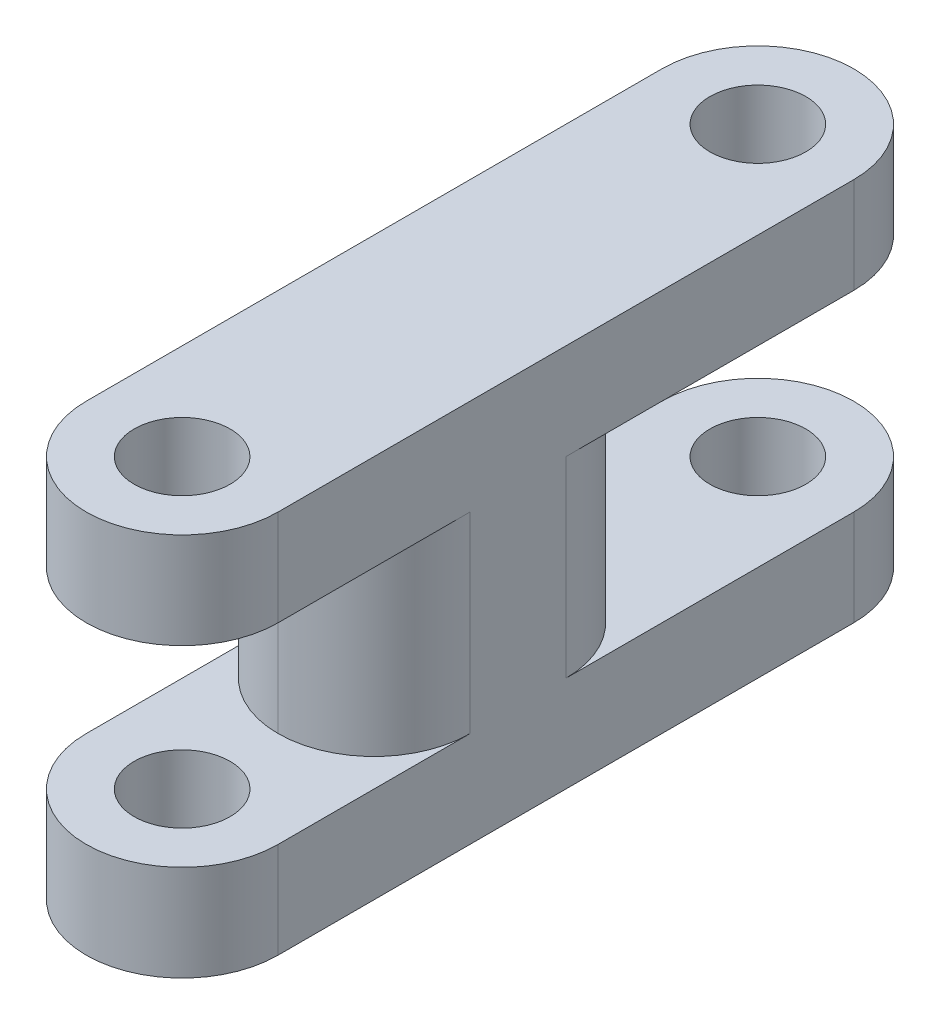
ISO-10303-21;
HEADER;
FILE_DESCRIPTION(('STEP AP214'),'2;1');
FILE_NAME('part.step','',(''),(''),'','','');
FILE_SCHEMA(('AUTOMOTIVE_DESIGN { 1 0 10303 214 1 1 1 1 }'));
ENDSEC;
DATA;
#1=APPLICATION_CONTEXT('core data for automotive mechanical design processes');
#2=APPLICATION_PROTOCOL_DEFINITION('international standard','automotive_design',2000,#1);
#3=PRODUCT_CONTEXT('',#1,'mechanical');
#4=PRODUCT('Part','Part','',(#3));
#5=PRODUCT_RELATED_PRODUCT_CATEGORY('part','',(#4));
#6=PRODUCT_DEFINITION_FORMATION('','',#4);
#7=PRODUCT_DEFINITION_CONTEXT('part definition',#1,'design');
#8=PRODUCT_DEFINITION('design','',#6,#7);
#9=PRODUCT_DEFINITION_SHAPE('','',#8);
#10=(LENGTH_UNIT() NAMED_UNIT(*) SI_UNIT(.MILLI.,.METRE.));
#11=(NAMED_UNIT(*) PLANE_ANGLE_UNIT() SI_UNIT($,.RADIAN.));
#12=(NAMED_UNIT(*) SI_UNIT($,.STERADIAN.) SOLID_ANGLE_UNIT());
#13=UNCERTAINTY_MEASURE_WITH_UNIT(LENGTH_MEASURE(1.E-05),#10,'distance_accuracy_value','');
#14=(GEOMETRIC_REPRESENTATION_CONTEXT(3) GLOBAL_UNCERTAINTY_ASSIGNED_CONTEXT((#13)) GLOBAL_UNIT_ASSIGNED_CONTEXT((#10,
#11,#12)) REPRESENTATION_CONTEXT('',''));
#15=CARTESIAN_POINT('',(0.,0.,0.));
#16=DIRECTION('',(0.,0.,1.));
#17=DIRECTION('',(1.,0.,0.));
#18=AXIS2_PLACEMENT_3D('',#15,#16,#17);
#19=CARTESIAN_POINT('',(5.,20.,0.));
#20=DIRECTION('',(-1.,0.,0.));
#21=DIRECTION('',(0.,0.,1.));
#22=AXIS2_PLACEMENT_3D('',#19,#20,#21);
#23=PLANE('',#22);
#24=DIRECTION('',(0.,1.,0.));
#25=VECTOR('',#24,1.);
#26=CARTESIAN_POINT('',(5.,20.,-15.));
#27=LINE('',#26,#25);
#28=CARTESIAN_POINT('',(5.,5.,-15.));
#29=VERTEX_POINT('',#28);
#30=CARTESIAN_POINT('',(5.,15.,-15.));
#31=VERTEX_POINT('',#30);
#32=EDGE_CURVE('E158',#29,#31,#27,.T.);
#33=ORIENTED_EDGE('',*,*,#32,.T.);
#34=DIRECTION('',(0.,0.,-1.));
#35=VECTOR('',#34,1.);
#36=CARTESIAN_POINT('',(5.,15.,-35.));
#37=LINE('',#36,#35);
#38=CARTESIAN_POINT('',(5.,15.,-30.));
#39=VERTEX_POINT('',#38);
#40=EDGE_CURVE('E143',#31,#39,#37,.T.);
#41=ORIENTED_EDGE('',*,*,#40,.T.);
#42=DIRECTION('',(0.,-1.,0.));
#43=VECTOR('',#42,1.);
#44=CARTESIAN_POINT('',(5.,20.,-30.));
#45=LINE('',#44,#43);
#46=CARTESIAN_POINT('',(5.,20.,-30.));
#47=VERTEX_POINT('',#46);
#48=EDGE_CURVE('E155',#47,#39,#45,.T.);
#49=ORIENTED_EDGE('',*,*,#48,.F.);
#50=DIRECTION('',(0.,0.,-1.));
#51=VECTOR('',#50,1.);
#52=CARTESIAN_POINT('',(5.,20.,0.));
#53=LINE('',#52,#51);
#54=CARTESIAN_POINT('',(5.,20.,0.));
#55=VERTEX_POINT('',#54);
#56=EDGE_CURVE('E292',#55,#47,#53,.T.);
#57=ORIENTED_EDGE('',*,*,#56,.F.);
#58=DIRECTION('',(0.,-1.,0.));
#59=VECTOR('',#58,1.);
#60=CARTESIAN_POINT('',(5.,20.,0.));
#61=LINE('',#60,#59);
#62=CARTESIAN_POINT('',(5.,15.,0.));
#63=VERTEX_POINT('',#62);
#64=EDGE_CURVE('E171',#55,#63,#61,.T.);
#65=ORIENTED_EDGE('',*,*,#64,.T.);
#66=DIRECTION('',(0.,0.,1.));
#67=VECTOR('',#66,1.);
#68=CARTESIAN_POINT('',(5.,15.,5.));
#69=LINE('',#68,#67);
#70=CARTESIAN_POINT('',(5.,15.,-10.));
#71=VERTEX_POINT('',#70);
#72=EDGE_CURVE('E185',#71,#63,#69,.T.);
#73=ORIENTED_EDGE('',*,*,#72,.F.);
#74=DIRECTION('',(0.,1.,0.));
#75=VECTOR('',#74,1.);
#76=CARTESIAN_POINT('',(5.,20.,-10.));
#77=LINE('',#76,#75);
#78=CARTESIAN_POINT('',(5.,5.,-10.));
#79=VERTEX_POINT('',#78);
#80=EDGE_CURVE('E203',#71,#79,#77,.F.);
#81=ORIENTED_EDGE('',*,*,#80,.T.);
#82=DIRECTION('',(0.,0.,-1.));
#83=VECTOR('',#82,1.);
#84=CARTESIAN_POINT('',(5.,5.,5.));
#85=LINE('',#84,#83);
#86=CARTESIAN_POINT('',(5.,5.,0.));
#87=VERTEX_POINT('',#86);
#88=EDGE_CURVE('E255',#87,#79,#85,.T.);
#89=ORIENTED_EDGE('',*,*,#88,.F.);
#90=CARTESIAN_POINT('',(5.,0.,0.));
#91=VERTEX_POINT('',#90);
#92=EDGE_CURVE('E166',#87,#91,#61,.T.);
#93=ORIENTED_EDGE('',*,*,#92,.T.);
#94=DIRECTION('',(0.,0.,-1.));
#95=VECTOR('',#94,1.);
#96=CARTESIAN_POINT('',(5.,0.,0.));
#97=LINE('',#96,#95);
#98=CARTESIAN_POINT('',(5.,0.,-30.));
#99=VERTEX_POINT('',#98);
#100=EDGE_CURVE('E305',#91,#99,#97,.T.);
#101=ORIENTED_EDGE('',*,*,#100,.T.);
#102=CARTESIAN_POINT('',(5.,5.,-30.));
#103=VERTEX_POINT('',#102);
#104=EDGE_CURVE('E167',#103,#99,#45,.T.);
#105=ORIENTED_EDGE('',*,*,#104,.F.);
#106=DIRECTION('',(0.,0.,1.));
#107=VECTOR('',#106,1.);
#108=CARTESIAN_POINT('',(5.,5.,-35.));
#109=LINE('',#108,#107);
#110=EDGE_CURVE('E160',#103,#29,#109,.T.);
#111=ORIENTED_EDGE('',*,*,#110,.T.);
#112=EDGE_LOOP('',(#33,#41,#49,#57,#65,#73,#81,#89,#93,#101,#105,#111));
#113=FACE_BOUND('',#112,.T.);
#114=ADVANCED_FACE('F39',(#113),#23,.F.);
#115=CARTESIAN_POINT('',(0.,20.,-30.));
#116=DIRECTION('',(0.,-1.,0.));
#117=DIRECTION('',(0.,0.,-1.));
#118=AXIS2_PLACEMENT_3D('',#115,#116,#117);
#119=CYLINDRICAL_SURFACE('',#118,5.);
#120=CARTESIAN_POINT('',(0.,5.,-30.));
#121=DIRECTION('',(0.,1.,0.));
#122=DIRECTION('',(0.,0.,1.));
#123=AXIS2_PLACEMENT_3D('',#120,#121,#122);
#124=CIRCLE('',#123,5.);
#125=CARTESIAN_POINT('',(-5.,5.,-30.));
#126=VERTEX_POINT('',#125);
#127=EDGE_CURVE('E252',#103,#126,#124,.T.);
#128=ORIENTED_EDGE('',*,*,#127,.F.);
#129=ORIENTED_EDGE('',*,*,#104,.T.);
#130=CARTESIAN_POINT('',(0.,0.,-30.));
#131=DIRECTION('',(0.,1.,0.));
#132=DIRECTION('',(0.,0.,1.));
#133=AXIS2_PLACEMENT_3D('',#130,#131,#132);
#134=CIRCLE('',#133,5.);
#135=CARTESIAN_POINT('',(-5.,0.,-30.));
#136=VERTEX_POINT('',#135);
#137=EDGE_CURVE('E309',#99,#136,#134,.T.);
#138=ORIENTED_EDGE('',*,*,#137,.T.);
#139=DIRECTION('',(0.,-1.,0.));
#140=VECTOR('',#139,1.);
#141=CARTESIAN_POINT('',(-5.,20.,-30.));
#142=LINE('',#141,#140);
#143=EDGE_CURVE('E318',#126,#136,#142,.T.);
#144=ORIENTED_EDGE('',*,*,#143,.F.);
#145=EDGE_LOOP('',(#128,#129,#138,#144));
#146=FACE_BOUND('',#145,.T.);
#147=ADVANCED_FACE('F364',(#146),#119,.T.);
#148=CARTESIAN_POINT('',(0.,15.,-30.));
#149=DIRECTION('',(0.,-1.,0.));
#150=DIRECTION('',(0.,0.,-1.));
#151=AXIS2_PLACEMENT_3D('',#148,#149,#150);
#152=CIRCLE('',#151,5.);
#153=CARTESIAN_POINT('',(-5.,15.,-30.));
#154=VERTEX_POINT('',#153);
#155=EDGE_CURVE('E140',#154,#39,#152,.T.);
#156=ORIENTED_EDGE('',*,*,#155,.F.);
#157=CARTESIAN_POINT('',(-5.,20.,-30.));
#158=VERTEX_POINT('',#157);
#159=EDGE_CURVE('E173',#158,#154,#142,.T.);
#160=ORIENTED_EDGE('',*,*,#159,.F.);
#161=CARTESIAN_POINT('',(0.,20.,-30.));
#162=DIRECTION('',(0.,1.,0.));
#163=DIRECTION('',(0.,0.,1.));
#164=AXIS2_PLACEMENT_3D('',#161,#162,#163);
#165=CIRCLE('',#164,5.);
#166=EDGE_CURVE('E164',#47,#158,#165,.T.);
#167=ORIENTED_EDGE('',*,*,#166,.F.);
#168=ORIENTED_EDGE('',*,*,#48,.T.);
#169=EDGE_LOOP('',(#156,#160,#167,#168));
#170=FACE_BOUND('',#169,.T.);
#171=ADVANCED_FACE('F163',(#170),#119,.T.);
#172=CARTESIAN_POINT('',(-5.,20.,0.));
#173=DIRECTION('',(1.,0.,0.));
#174=DIRECTION('',(0.,0.,-1.));
#175=AXIS2_PLACEMENT_3D('',#172,#173,#174);
#176=PLANE('',#175);
#177=DIRECTION('',(0.,-1.,0.));
#178=VECTOR('',#177,1.);
#179=CARTESIAN_POINT('',(-5.,20.,-15.));
#180=LINE('',#179,#178);
#181=CARTESIAN_POINT('',(-5.,15.,-15.));
#182=VERTEX_POINT('',#181);
#183=CARTESIAN_POINT('',(-5.,5.,-15.));
#184=VERTEX_POINT('',#183);
#185=EDGE_CURVE('E221',#182,#184,#180,.T.);
#186=ORIENTED_EDGE('',*,*,#185,.T.);
#187=DIRECTION('',(0.,0.,1.));
#188=VECTOR('',#187,1.);
#189=CARTESIAN_POINT('',(-5.,5.,0.));
#190=LINE('',#189,#188);
#191=EDGE_CURVE('E199',#126,#184,#190,.T.);
#192=ORIENTED_EDGE('',*,*,#191,.F.);
#193=ORIENTED_EDGE('',*,*,#143,.T.);
#194=DIRECTION('',(0.,0.,1.));
#195=VECTOR('',#194,1.);
#196=CARTESIAN_POINT('',(-5.,0.,0.));
#197=LINE('',#196,#195);
#198=CARTESIAN_POINT('',(-5.,0.,0.));
#199=VERTEX_POINT('',#198);
#200=EDGE_CURVE('E293',#136,#199,#197,.T.);
#201=ORIENTED_EDGE('',*,*,#200,.T.);
#202=DIRECTION('',(0.,-1.,0.));
#203=VECTOR('',#202,1.);
#204=CARTESIAN_POINT('',(-5.,20.,0.));
#205=LINE('',#204,#203);
#206=CARTESIAN_POINT('',(-5.,5.,0.));
#207=VERTEX_POINT('',#206);
#208=EDGE_CURVE('E301',#207,#199,#205,.T.);
#209=ORIENTED_EDGE('',*,*,#208,.F.);
#210=DIRECTION('',(0.,0.,-1.));
#211=VECTOR('',#210,1.);
#212=CARTESIAN_POINT('',(-5.,5.,0.));
#213=LINE('',#212,#211);
#214=CARTESIAN_POINT('',(-5.,5.,-10.));
#215=VERTEX_POINT('',#214);
#216=EDGE_CURVE('E184',#207,#215,#213,.T.);
#217=ORIENTED_EDGE('',*,*,#216,.T.);
#218=DIRECTION('',(0.,1.,0.));
#219=VECTOR('',#218,1.);
#220=CARTESIAN_POINT('',(-5.,20.,-10.));
#221=LINE('',#220,#219);
#222=CARTESIAN_POINT('',(-5.,15.,-10.));
#223=VERTEX_POINT('',#222);
#224=EDGE_CURVE('E179',#215,#223,#221,.T.);
#225=ORIENTED_EDGE('',*,*,#224,.T.);
#226=DIRECTION('',(0.,0.,1.));
#227=VECTOR('',#226,1.);
#228=CARTESIAN_POINT('',(-5.,15.,0.));
#229=LINE('',#228,#227);
#230=CARTESIAN_POINT('',(-5.,15.,0.));
#231=VERTEX_POINT('',#230);
#232=EDGE_CURVE('E190',#223,#231,#229,.T.);
#233=ORIENTED_EDGE('',*,*,#232,.T.);
#234=CARTESIAN_POINT('',(-5.,20.,0.));
#235=VERTEX_POINT('',#234);
#236=EDGE_CURVE('E315',#235,#231,#205,.T.);
#237=ORIENTED_EDGE('',*,*,#236,.F.);
#238=DIRECTION('',(0.,0.,1.));
#239=VECTOR('',#238,1.);
#240=CARTESIAN_POINT('',(-5.,20.,0.));
#241=LINE('',#240,#239);
#242=EDGE_CURVE('E298',#158,#235,#241,.T.);
#243=ORIENTED_EDGE('',*,*,#242,.F.);
#244=ORIENTED_EDGE('',*,*,#159,.T.);
#245=DIRECTION('',(0.,0.,-1.));
#246=VECTOR('',#245,1.);
#247=CARTESIAN_POINT('',(-5.,15.,0.));
#248=LINE('',#247,#246);
#249=EDGE_CURVE('E145',#182,#154,#248,.T.);
#250=ORIENTED_EDGE('',*,*,#249,.F.);
#251=EDGE_LOOP('',(#186,#192,#193,#201,#209,#217,#225,#233,#237,#243,#244,#250));
#252=FACE_BOUND('',#251,.T.);
#253=ADVANCED_FACE('F243',(#252),#176,.F.);
#254=CARTESIAN_POINT('',(0.,20.,-30.));
#255=DIRECTION('',(0.,-1.,0.));
#256=DIRECTION('',(0.,0.,-1.));
#257=AXIS2_PLACEMENT_3D('',#254,#255,#256);
#258=CYLINDRICAL_SURFACE('',#257,2.5);
#259=CARTESIAN_POINT('',(0.,0.,-30.));
#260=DIRECTION('',(0.,1.,0.));
#261=DIRECTION('',(0.,0.,1.));
#262=AXIS2_PLACEMENT_3D('',#259,#260,#261);
#263=CIRCLE('',#262,2.5);
#264=CARTESIAN_POINT('',(0.,0.,-27.5));
#265=VERTEX_POINT('',#264);
#266=EDGE_CURVE('E276',#265,#265,#263,.T.);
#267=ORIENTED_EDGE('',*,*,#266,.F.);
#268=EDGE_LOOP('',(#267));
#269=FACE_BOUND('',#268,.T.);
#270=CARTESIAN_POINT('',(0.,5.,-30.));
#271=DIRECTION('',(0.,1.,0.));
#272=DIRECTION('',(0.,0.,1.));
#273=AXIS2_PLACEMENT_3D('',#270,#271,#272);
#274=CIRCLE('',#273,2.5);
#275=CARTESIAN_POINT('',(0.,5.,-27.5));
#276=VERTEX_POINT('',#275);
#277=EDGE_CURVE('E151',#276,#276,#274,.T.);
#278=ORIENTED_EDGE('',*,*,#277,.T.);
#279=EDGE_LOOP('',(#278));
#280=FACE_BOUND('',#279,.T.);
#281=ADVANCED_FACE('F392',(#269,#280),#258,.F.);
#282=CARTESIAN_POINT('',(0.,20.,-30.));
#283=DIRECTION('',(0.,1.,0.));
#284=DIRECTION('',(0.,0.,1.));
#285=AXIS2_PLACEMENT_3D('',#282,#283,#284);
#286=CIRCLE('',#285,2.5);
#287=CARTESIAN_POINT('',(0.,20.,-27.5));
#288=VERTEX_POINT('',#287);
#289=EDGE_CURVE('E280',#288,#288,#286,.T.);
#290=ORIENTED_EDGE('',*,*,#289,.T.);
#291=EDGE_LOOP('',(#290));
#292=FACE_BOUND('',#291,.T.);
#293=CARTESIAN_POINT('',(0.,15.,-30.));
#294=DIRECTION('',(0.,-1.,0.));
#295=DIRECTION('',(0.,0.,-1.));
#296=AXIS2_PLACEMENT_3D('',#293,#294,#295);
#297=CIRCLE('',#296,2.5);
#298=CARTESIAN_POINT('',(0.,15.,-32.5));
#299=VERTEX_POINT('',#298);
#300=EDGE_CURVE('E192',#299,#299,#297,.T.);
#301=ORIENTED_EDGE('',*,*,#300,.T.);
#302=EDGE_LOOP('',(#301));
#303=FACE_BOUND('',#302,.T.);
#304=ADVANCED_FACE('F386',(#292,#303),#258,.F.);
#305=CARTESIAN_POINT('',(0.,20.,0.));
#306=DIRECTION('',(0.,-1.,0.));
#307=DIRECTION('',(0.,0.,-1.));
#308=AXIS2_PLACEMENT_3D('',#305,#306,#307);
#309=CYLINDRICAL_SURFACE('',#308,5.);
#310=CARTESIAN_POINT('',(0.,15.,0.));
#311=DIRECTION('',(0.,1.,0.));
#312=DIRECTION('',(0.,0.,1.));
#313=AXIS2_PLACEMENT_3D('',#310,#311,#312);
#314=CIRCLE('',#313,5.);
#315=EDGE_CURVE('E268',#231,#63,#314,.T.);
#316=ORIENTED_EDGE('',*,*,#315,.T.);
#317=ORIENTED_EDGE('',*,*,#64,.F.);
#318=CARTESIAN_POINT('',(0.,20.,0.));
#319=DIRECTION('',(0.,1.,0.));
#320=DIRECTION('',(0.,0.,1.));
#321=AXIS2_PLACEMENT_3D('',#318,#319,#320);
#322=CIRCLE('',#321,5.);
#323=EDGE_CURVE('E288',#235,#55,#322,.T.);
#324=ORIENTED_EDGE('',*,*,#323,.F.);
#325=ORIENTED_EDGE('',*,*,#236,.T.);
#326=EDGE_LOOP('',(#316,#317,#324,#325));
#327=FACE_BOUND('',#326,.T.);
#328=ADVANCED_FACE('F375',(#327),#309,.T.);
#329=CARTESIAN_POINT('',(0.,20.,0.));
#330=DIRECTION('',(0.,-1.,0.));
#331=DIRECTION('',(0.,0.,-1.));
#332=AXIS2_PLACEMENT_3D('',#329,#330,#331);
#333=CYLINDRICAL_SURFACE('',#332,2.5);
#334=CARTESIAN_POINT('',(0.,15.,0.));
#335=DIRECTION('',(0.,1.,0.));
#336=DIRECTION('',(0.,0.,1.));
#337=AXIS2_PLACEMENT_3D('',#334,#335,#336);
#338=CIRCLE('',#337,2.5);
#339=CARTESIAN_POINT('',(0.,15.,2.5));
#340=VERTEX_POINT('',#339);
#341=EDGE_CURVE('E186',#340,#340,#338,.T.);
#342=ORIENTED_EDGE('',*,*,#341,.F.);
#343=EDGE_LOOP('',(#342));
#344=FACE_BOUND('',#343,.T.);
#345=CARTESIAN_POINT('',(0.,20.,0.));
#346=DIRECTION('',(0.,1.,0.));
#347=DIRECTION('',(0.,0.,1.));
#348=AXIS2_PLACEMENT_3D('',#345,#346,#347);
#349=CIRCLE('',#348,2.5);
#350=CARTESIAN_POINT('',(0.,20.,2.5));
#351=VERTEX_POINT('',#350);
#352=EDGE_CURVE('E272',#351,#351,#349,.T.);
#353=ORIENTED_EDGE('',*,*,#352,.T.);
#354=EDGE_LOOP('',(#353));
#355=FACE_BOUND('',#354,.T.);
#356=ADVANCED_FACE('F382',(#344,#355),#333,.F.);
#357=CARTESIAN_POINT('',(0.,20.,0.));
#358=DIRECTION('',(0.,1.,0.));
#359=DIRECTION('',(0.,0.,1.));
#360=AXIS2_PLACEMENT_3D('',#357,#358,#359);
#361=PLANE('',#360);
#362=ORIENTED_EDGE('',*,*,#289,.F.);
#363=EDGE_LOOP('',(#362));
#364=FACE_BOUND('',#363,.T.);
#365=ORIENTED_EDGE('',*,*,#323,.T.);
#366=ORIENTED_EDGE('',*,*,#56,.T.);
#367=ORIENTED_EDGE('',*,*,#166,.T.);
#368=ORIENTED_EDGE('',*,*,#242,.T.);
#369=EDGE_LOOP('',(#365,#366,#367,#368));
#370=FACE_BOUND('',#369,.T.);
#371=ORIENTED_EDGE('',*,*,#352,.F.);
#372=EDGE_LOOP('',(#371));
#373=FACE_BOUND('',#372,.T.);
#374=ADVANCED_FACE('F383',(#364,#370,#373),#361,.T.);
#375=CARTESIAN_POINT('',(0.,0.,0.));
#376=DIRECTION('',(0.,1.,0.));
#377=DIRECTION('',(0.,0.,1.));
#378=AXIS2_PLACEMENT_3D('',#375,#376,#377);
#379=PLANE('',#378);
#380=CARTESIAN_POINT('',(0.,0.,0.));
#381=DIRECTION('',(0.,1.,0.));
#382=DIRECTION('',(0.,0.,1.));
#383=AXIS2_PLACEMENT_3D('',#380,#381,#382);
#384=CIRCLE('',#383,5.);
#385=EDGE_CURVE('E284',#199,#91,#384,.T.);
#386=ORIENTED_EDGE('',*,*,#385,.F.);
#387=ORIENTED_EDGE('',*,*,#200,.F.);
#388=ORIENTED_EDGE('',*,*,#137,.F.);
#389=ORIENTED_EDGE('',*,*,#100,.F.);
#390=EDGE_LOOP('',(#386,#387,#388,#389));
#391=FACE_BOUND('',#390,.T.);
#392=ORIENTED_EDGE('',*,*,#266,.T.);
#393=EDGE_LOOP('',(#392));
#394=FACE_BOUND('',#393,.T.);
#395=CARTESIAN_POINT('',(0.,0.,0.));
#396=DIRECTION('',(0.,1.,0.));
#397=DIRECTION('',(0.,0.,1.));
#398=AXIS2_PLACEMENT_3D('',#395,#396,#397);
#399=CIRCLE('',#398,2.5);
#400=CARTESIAN_POINT('',(0.,0.,2.5));
#401=VERTEX_POINT('',#400);
#402=EDGE_CURVE('E271',#401,#401,#399,.T.);
#403=ORIENTED_EDGE('',*,*,#402,.T.);
#404=EDGE_LOOP('',(#403));
#405=FACE_BOUND('',#404,.T.);
#406=ADVANCED_FACE('F334',(#391,#394,#405),#379,.F.);
#407=ORIENTED_EDGE('',*,*,#92,.F.);
#408=CARTESIAN_POINT('',(0.,5.,0.));
#409=DIRECTION('',(0.,-1.,0.));
#410=DIRECTION('',(0.,0.,-1.));
#411=AXIS2_PLACEMENT_3D('',#408,#409,#410);
#412=CIRCLE('',#411,5.);
#413=EDGE_CURVE('E191',#87,#207,#412,.T.);
#414=ORIENTED_EDGE('',*,*,#413,.T.);
#415=ORIENTED_EDGE('',*,*,#208,.T.);
#416=ORIENTED_EDGE('',*,*,#385,.T.);
#417=EDGE_LOOP('',(#407,#414,#415,#416));
#418=FACE_BOUND('',#417,.T.);
#419=ADVANCED_FACE('F327',(#418),#309,.T.);
#420=CARTESIAN_POINT('',(0.,5.,0.));
#421=DIRECTION('',(0.,-1.,0.));
#422=DIRECTION('',(0.,0.,-1.));
#423=AXIS2_PLACEMENT_3D('',#420,#421,#422);
#424=CIRCLE('',#423,2.5);
#425=CARTESIAN_POINT('',(0.,5.,-2.5));
#426=VERTEX_POINT('',#425);
#427=EDGE_CURVE('E180',#426,#426,#424,.T.);
#428=ORIENTED_EDGE('',*,*,#427,.F.);
#429=EDGE_LOOP('',(#428));
#430=FACE_BOUND('',#429,.T.);
#431=ORIENTED_EDGE('',*,*,#402,.F.);
#432=EDGE_LOOP('',(#431));
#433=FACE_BOUND('',#432,.T.);
#434=ADVANCED_FACE('F374',(#430,#433),#333,.F.);
#435=CARTESIAN_POINT('',(-10.,15.,5.));
#436=DIRECTION('',(0.,1.,0.));
#437=DIRECTION('',(0.,0.,1.));
#438=AXIS2_PLACEMENT_3D('',#435,#436,#437);
#439=PLANE('',#438);
#440=ORIENTED_EDGE('',*,*,#341,.T.);
#441=EDGE_LOOP('',(#440));
#442=FACE_BOUND('',#441,.T.);
#443=ORIENTED_EDGE('',*,*,#315,.F.);
#444=ORIENTED_EDGE('',*,*,#232,.F.);
#445=CARTESIAN_POINT('',(0.,15.,-10.));
#446=DIRECTION('',(0.,1.,0.));
#447=DIRECTION('',(0.,0.,1.));
#448=AXIS2_PLACEMENT_3D('',#445,#446,#447);
#449=CIRCLE('',#448,5.);
#450=CARTESIAN_POINT('',(0.,15.,-5.));
#451=VERTEX_POINT('',#450);
#452=EDGE_CURVE('E207',#223,#451,#449,.T.);
#453=ORIENTED_EDGE('',*,*,#452,.T.);
#454=CARTESIAN_POINT('',(0.,15.,-10.));
#455=DIRECTION('',(0.,1.,0.));
#456=DIRECTION('',(0.,0.,1.));
#457=AXIS2_PLACEMENT_3D('',#454,#455,#456);
#458=CIRCLE('',#457,5.);
#459=EDGE_CURVE('E214',#451,#71,#458,.T.);
#460=ORIENTED_EDGE('',*,*,#459,.T.);
#461=ORIENTED_EDGE('',*,*,#72,.T.);
#462=EDGE_LOOP('',(#443,#444,#453,#460,#461));
#463=FACE_BOUND('',#462,.T.);
#464=ADVANCED_FACE('F350',(#442,#463),#439,.F.);
#465=CARTESIAN_POINT('',(-10.,5.,5.));
#466=DIRECTION('',(0.,-1.,0.));
#467=DIRECTION('',(0.,0.,-1.));
#468=AXIS2_PLACEMENT_3D('',#465,#466,#467);
#469=PLANE('',#468);
#470=ORIENTED_EDGE('',*,*,#427,.T.);
#471=EDGE_LOOP('',(#470));
#472=FACE_BOUND('',#471,.T.);
#473=ORIENTED_EDGE('',*,*,#88,.T.);
#474=CARTESIAN_POINT('',(0.,5.,-10.));
#475=DIRECTION('',(0.,-1.,0.));
#476=DIRECTION('',(0.,0.,-1.));
#477=AXIS2_PLACEMENT_3D('',#474,#475,#476);
#478=CIRCLE('',#477,5.);
#479=CARTESIAN_POINT('',(0.,5.,-5.));
#480=VERTEX_POINT('',#479);
#481=EDGE_CURVE('E218',#79,#480,#478,.T.);
#482=ORIENTED_EDGE('',*,*,#481,.T.);
#483=CARTESIAN_POINT('',(0.,5.,-10.));
#484=DIRECTION('',(0.,-1.,0.));
#485=DIRECTION('',(0.,0.,-1.));
#486=AXIS2_PLACEMENT_3D('',#483,#484,#485);
#487=CIRCLE('',#486,5.);
#488=EDGE_CURVE('E210',#480,#215,#487,.T.);
#489=ORIENTED_EDGE('',*,*,#488,.T.);
#490=ORIENTED_EDGE('',*,*,#216,.F.);
#491=ORIENTED_EDGE('',*,*,#413,.F.);
#492=EDGE_LOOP('',(#473,#482,#489,#490,#491));
#493=FACE_BOUND('',#492,.T.);
#494=ADVANCED_FACE('F341',(#472,#493),#469,.F.);
#495=CARTESIAN_POINT('',(-10.,5.,-35.));
#496=DIRECTION('',(0.,1.,0.));
#497=DIRECTION('',(0.,0.,1.));
#498=AXIS2_PLACEMENT_3D('',#495,#496,#497);
#499=PLANE('',#498);
#500=ORIENTED_EDGE('',*,*,#277,.F.);
#501=EDGE_LOOP('',(#500));
#502=FACE_BOUND('',#501,.T.);
#503=ORIENTED_EDGE('',*,*,#110,.F.);
#504=ORIENTED_EDGE('',*,*,#127,.T.);
#505=ORIENTED_EDGE('',*,*,#191,.T.);
#506=CARTESIAN_POINT('',(0.,5.,-15.));
#507=DIRECTION('',(0.,1.,0.));
#508=DIRECTION('',(0.,0.,1.));
#509=AXIS2_PLACEMENT_3D('',#506,#507,#508);
#510=CIRCLE('',#509,5.);
#511=CARTESIAN_POINT('',(0.,5.,-20.));
#512=VERTEX_POINT('',#511);
#513=EDGE_CURVE('E62',#184,#512,#510,.F.);
#514=ORIENTED_EDGE('',*,*,#513,.T.);
#515=CARTESIAN_POINT('',(0.,5.,-15.));
#516=DIRECTION('',(0.,1.,0.));
#517=DIRECTION('',(0.,0.,1.));
#518=AXIS2_PLACEMENT_3D('',#515,#516,#517);
#519=CIRCLE('',#518,5.);
#520=EDGE_CURVE('E11',#512,#29,#519,.F.);
#521=ORIENTED_EDGE('',*,*,#520,.T.);
#522=EDGE_LOOP('',(#503,#504,#505,#514,#521));
#523=FACE_BOUND('',#522,.T.);
#524=ADVANCED_FACE('F360',(#502,#523),#499,.T.);
#525=CARTESIAN_POINT('',(-10.,15.,-35.));
#526=DIRECTION('',(0.,-1.,0.));
#527=DIRECTION('',(0.,0.,-1.));
#528=AXIS2_PLACEMENT_3D('',#525,#526,#527);
#529=PLANE('',#528);
#530=ORIENTED_EDGE('',*,*,#300,.F.);
#531=EDGE_LOOP('',(#530));
#532=FACE_BOUND('',#531,.T.);
#533=ORIENTED_EDGE('',*,*,#249,.T.);
#534=ORIENTED_EDGE('',*,*,#155,.T.);
#535=ORIENTED_EDGE('',*,*,#40,.F.);
#536=CARTESIAN_POINT('',(0.,15.,-15.));
#537=DIRECTION('',(0.,-1.,0.));
#538=DIRECTION('',(0.,0.,-1.));
#539=AXIS2_PLACEMENT_3D('',#536,#537,#538);
#540=CIRCLE('',#539,5.);
#541=CARTESIAN_POINT('',(0.,15.,-20.));
#542=VERTEX_POINT('',#541);
#543=EDGE_CURVE('E49',#31,#542,#540,.F.);
#544=ORIENTED_EDGE('',*,*,#543,.T.);
#545=CARTESIAN_POINT('',(0.,15.,-15.));
#546=DIRECTION('',(0.,-1.,0.));
#547=DIRECTION('',(0.,0.,-1.));
#548=AXIS2_PLACEMENT_3D('',#545,#546,#547);
#549=CIRCLE('',#548,5.);
#550=EDGE_CURVE('E232',#542,#182,#549,.F.);
#551=ORIENTED_EDGE('',*,*,#550,.T.);
#552=EDGE_LOOP('',(#533,#534,#535,#544,#551));
#553=FACE_BOUND('',#552,.T.);
#554=ADVANCED_FACE('F142',(#532,#553),#529,.T.);
#555=CARTESIAN_POINT('',(0.,15.,-10.));
#556=DIRECTION('',(0.,1.,0.));
#557=DIRECTION('',(0.,0.,1.));
#558=AXIS2_PLACEMENT_3D('',#555,#556,#557);
#559=CYLINDRICAL_SURFACE('',#558,5.);
#560=DIRECTION('',(0.,1.,0.));
#561=VECTOR('',#560,1.);
#562=CARTESIAN_POINT('',(0.,15.,-5.));
#563=LINE('',#562,#561);
#564=EDGE_CURVE('E161',#480,#451,#563,.T.);
#565=ORIENTED_EDGE('',*,*,#564,.F.);
#566=ORIENTED_EDGE('',*,*,#481,.F.);
#567=ORIENTED_EDGE('',*,*,#80,.F.);
#568=ORIENTED_EDGE('',*,*,#459,.F.);
#569=EDGE_LOOP('',(#565,#566,#567,#568));
#570=FACE_BOUND('',#569,.T.);
#571=ADVANCED_FACE('F352',(#570),#559,.T.);
#572=CARTESIAN_POINT('',(0.,20.,-10.));
#573=DIRECTION('',(0.,1.,0.));
#574=DIRECTION('',(0.,0.,1.));
#575=AXIS2_PLACEMENT_3D('',#572,#573,#574);
#576=CYLINDRICAL_SURFACE('',#575,5.);
#577=ORIENTED_EDGE('',*,*,#488,.F.);
#578=ORIENTED_EDGE('',*,*,#564,.T.);
#579=ORIENTED_EDGE('',*,*,#452,.F.);
#580=ORIENTED_EDGE('',*,*,#224,.F.);
#581=EDGE_LOOP('',(#577,#578,#579,#580));
#582=FACE_BOUND('',#581,.T.);
#583=ADVANCED_FACE('F347',(#582),#576,.T.);
#584=CARTESIAN_POINT('',(0.,20.,-15.));
#585=DIRECTION('',(0.,1.,0.));
#586=DIRECTION('',(0.,0.,1.));
#587=AXIS2_PLACEMENT_3D('',#584,#585,#586);
#588=CYLINDRICAL_SURFACE('',#587,5.);
#589=DIRECTION('',(0.,1.,0.));
#590=VECTOR('',#589,1.);
#591=CARTESIAN_POINT('',(0.,15.,-20.));
#592=LINE('',#591,#590);
#593=EDGE_CURVE('E43',#542,#512,#592,.F.);
#594=ORIENTED_EDGE('',*,*,#593,.F.);
#595=ORIENTED_EDGE('',*,*,#543,.F.);
#596=ORIENTED_EDGE('',*,*,#32,.F.);
#597=ORIENTED_EDGE('',*,*,#520,.F.);
#598=EDGE_LOOP('',(#594,#595,#596,#597));
#599=FACE_BOUND('',#598,.T.);
#600=ADVANCED_FACE('F41',(#599),#588,.T.);
#601=CARTESIAN_POINT('',(0.,20.,-15.));
#602=DIRECTION('',(0.,-1.,0.));
#603=DIRECTION('',(0.,0.,-1.));
#604=AXIS2_PLACEMENT_3D('',#601,#602,#603);
#605=CYLINDRICAL_SURFACE('',#604,5.);
#606=ORIENTED_EDGE('',*,*,#550,.F.);
#607=ORIENTED_EDGE('',*,*,#593,.T.);
#608=ORIENTED_EDGE('',*,*,#513,.F.);
#609=ORIENTED_EDGE('',*,*,#185,.F.);
#610=EDGE_LOOP('',(#606,#607,#608,#609));
#611=FACE_BOUND('',#610,.T.);
#612=ADVANCED_FACE('F240',(#611),#605,.T.);
#613=CLOSED_SHELL('',(#114,#147,#171,#253,#281,#304,#328,#356,#374,#406,#419,#434,#464,#494,
#524,#554,#571,#583,#600,#612));
#614=MANIFOLD_SOLID_BREP('B2',#613);
#615=ADVANCED_BREP_SHAPE_REPRESENTATION('',(#18,#614),#14);
#616=SHAPE_DEFINITION_REPRESENTATION(#9,#615);
ENDSEC;
END-ISO-10303-21;
